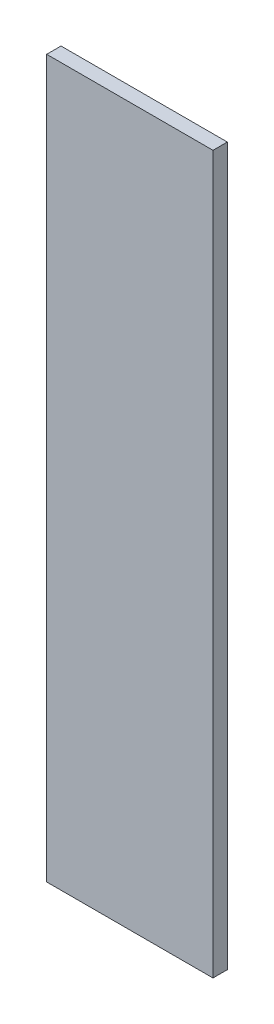
ISO-10303-21;
HEADER;
FILE_DESCRIPTION(('STEP AP214'),'2;1');
FILE_NAME('part.step','',(''),(''),'','','');
FILE_SCHEMA(('AUTOMOTIVE_DESIGN { 1 0 10303 214 1 1 1 1 }'));
ENDSEC;
DATA;
#1=APPLICATION_CONTEXT('core data for automotive mechanical design processes');
#2=APPLICATION_PROTOCOL_DEFINITION('international standard','automotive_design',2000,#1);
#3=PRODUCT_CONTEXT('',#1,'mechanical');
#4=PRODUCT('Part','Part','',(#3));
#5=PRODUCT_RELATED_PRODUCT_CATEGORY('part','',(#4));
#6=PRODUCT_DEFINITION_FORMATION('','',#4);
#7=PRODUCT_DEFINITION_CONTEXT('part definition',#1,'design');
#8=PRODUCT_DEFINITION('design','',#6,#7);
#9=PRODUCT_DEFINITION_SHAPE('','',#8);
#10=(LENGTH_UNIT() NAMED_UNIT(*) SI_UNIT(.MILLI.,.METRE.));
#11=(NAMED_UNIT(*) PLANE_ANGLE_UNIT() SI_UNIT($,.RADIAN.));
#12=(NAMED_UNIT(*) SI_UNIT($,.STERADIAN.) SOLID_ANGLE_UNIT());
#13=UNCERTAINTY_MEASURE_WITH_UNIT(LENGTH_MEASURE(1.E-05),#10,'distance_accuracy_value','');
#14=(GEOMETRIC_REPRESENTATION_CONTEXT(3) GLOBAL_UNCERTAINTY_ASSIGNED_CONTEXT((#13)) GLOBAL_UNIT_ASSIGNED_CONTEXT((#10,
#11,#12)) REPRESENTATION_CONTEXT('',''));
#15=CARTESIAN_POINT('',(0.,0.,0.));
#16=DIRECTION('',(0.,0.,1.));
#17=DIRECTION('',(1.,0.,0.));
#18=AXIS2_PLACEMENT_3D('',#15,#16,#17);
#19=CARTESIAN_POINT('',(0.,250.,5.));
#20=DIRECTION('',(1.,0.,0.));
#21=DIRECTION('',(0.,0.,-1.));
#22=AXIS2_PLACEMENT_3D('',#19,#20,#21);
#23=PLANE('',#22);
#24=DIRECTION('',(0.,-1.,0.));
#25=VECTOR('',#24,1.);
#26=CARTESIAN_POINT('',(0.,250.,0.));
#27=LINE('',#26,#25);
#28=CARTESIAN_POINT('',(0.,250.,0.));
#29=VERTEX_POINT('',#28);
#30=CARTESIAN_POINT('',(0.,0.,0.));
#31=VERTEX_POINT('',#30);
#32=EDGE_CURVE('E96',#29,#31,#27,.T.);
#33=ORIENTED_EDGE('',*,*,#32,.T.);
#34=DIRECTION('',(0.,0.,-1.));
#35=VECTOR('',#34,1.);
#36=CARTESIAN_POINT('',(0.,0.,5.));
#37=LINE('',#36,#35);
#38=CARTESIAN_POINT('',(0.,0.,5.));
#39=VERTEX_POINT('',#38);
#40=EDGE_CURVE('E11',#39,#31,#37,.T.);
#41=ORIENTED_EDGE('',*,*,#40,.F.);
#42=DIRECTION('',(0.,-1.,0.));
#43=VECTOR('',#42,1.);
#44=CARTESIAN_POINT('',(0.,250.,5.));
#45=LINE('',#44,#43);
#46=CARTESIAN_POINT('',(0.,250.,5.));
#47=VERTEX_POINT('',#46);
#48=EDGE_CURVE('E84',#47,#39,#45,.T.);
#49=ORIENTED_EDGE('',*,*,#48,.F.);
#50=DIRECTION('',(0.,0.,-1.));
#51=VECTOR('',#50,1.);
#52=CARTESIAN_POINT('',(0.,250.,5.));
#53=LINE('',#52,#51);
#54=EDGE_CURVE('E92',#47,#29,#53,.T.);
#55=ORIENTED_EDGE('',*,*,#54,.T.);
#56=EDGE_LOOP('',(#33,#41,#49,#55));
#57=FACE_BOUND('',#56,.T.);
#58=ADVANCED_FACE('F33',(#57),#23,.F.);
#59=CARTESIAN_POINT('',(0.,0.,5.));
#60=DIRECTION('',(0.,1.,0.));
#61=DIRECTION('',(0.,0.,1.));
#62=AXIS2_PLACEMENT_3D('',#59,#60,#61);
#63=PLANE('',#62);
#64=DIRECTION('',(1.,0.,0.));
#65=VECTOR('',#64,1.);
#66=CARTESIAN_POINT('',(0.,0.,0.));
#67=LINE('',#66,#65);
#68=CARTESIAN_POINT('',(58.,0.,0.));
#69=VERTEX_POINT('',#68);
#70=EDGE_CURVE('E88',#31,#69,#67,.T.);
#71=ORIENTED_EDGE('',*,*,#70,.T.);
#72=DIRECTION('',(0.,0.,-1.));
#73=VECTOR('',#72,1.);
#74=CARTESIAN_POINT('',(58.,0.,5.));
#75=LINE('',#74,#73);
#76=CARTESIAN_POINT('',(58.,0.,5.));
#77=VERTEX_POINT('',#76);
#78=EDGE_CURVE('E41',#77,#69,#75,.T.);
#79=ORIENTED_EDGE('',*,*,#78,.F.);
#80=DIRECTION('',(1.,0.,0.));
#81=VECTOR('',#80,1.);
#82=CARTESIAN_POINT('',(0.,0.,5.));
#83=LINE('',#82,#81);
#84=EDGE_CURVE('E79',#39,#77,#83,.T.);
#85=ORIENTED_EDGE('',*,*,#84,.F.);
#86=ORIENTED_EDGE('',*,*,#40,.T.);
#87=EDGE_LOOP('',(#71,#79,#85,#86));
#88=FACE_BOUND('',#87,.T.);
#89=ADVANCED_FACE('F87',(#88),#63,.F.);
#90=CARTESIAN_POINT('',(58.,0.,5.));
#91=DIRECTION('',(-1.,0.,0.));
#92=DIRECTION('',(0.,0.,1.));
#93=AXIS2_PLACEMENT_3D('',#90,#91,#92);
#94=PLANE('',#93);
#95=DIRECTION('',(0.,1.,0.));
#96=VECTOR('',#95,1.);
#97=CARTESIAN_POINT('',(58.,0.,0.));
#98=LINE('',#97,#96);
#99=CARTESIAN_POINT('',(58.,250.,0.));
#100=VERTEX_POINT('',#99);
#101=EDGE_CURVE('E66',#69,#100,#98,.T.);
#102=ORIENTED_EDGE('',*,*,#101,.T.);
#103=DIRECTION('',(0.,0.,-1.));
#104=VECTOR('',#103,1.);
#105=CARTESIAN_POINT('',(58.,250.,5.));
#106=LINE('',#105,#104);
#107=CARTESIAN_POINT('',(58.,250.,5.));
#108=VERTEX_POINT('',#107);
#109=EDGE_CURVE('E89',#108,#100,#106,.T.);
#110=ORIENTED_EDGE('',*,*,#109,.F.);
#111=DIRECTION('',(0.,1.,0.));
#112=VECTOR('',#111,1.);
#113=CARTESIAN_POINT('',(58.,0.,5.));
#114=LINE('',#113,#112);
#115=EDGE_CURVE('E82',#77,#108,#114,.T.);
#116=ORIENTED_EDGE('',*,*,#115,.F.);
#117=ORIENTED_EDGE('',*,*,#78,.T.);
#118=EDGE_LOOP('',(#102,#110,#116,#117));
#119=FACE_BOUND('',#118,.T.);
#120=ADVANCED_FACE('F90',(#119),#94,.F.);
#121=CARTESIAN_POINT('',(58.,250.,5.));
#122=DIRECTION('',(0.,-1.,0.));
#123=DIRECTION('',(0.,0.,-1.));
#124=AXIS2_PLACEMENT_3D('',#121,#122,#123);
#125=PLANE('',#124);
#126=DIRECTION('',(-1.,0.,0.));
#127=VECTOR('',#126,1.);
#128=CARTESIAN_POINT('',(58.,250.,0.));
#129=LINE('',#128,#127);
#130=EDGE_CURVE('E72',#100,#29,#129,.T.);
#131=ORIENTED_EDGE('',*,*,#130,.T.);
#132=ORIENTED_EDGE('',*,*,#54,.F.);
#133=DIRECTION('',(-1.,0.,0.));
#134=VECTOR('',#133,1.);
#135=CARTESIAN_POINT('',(58.,250.,5.));
#136=LINE('',#135,#134);
#137=EDGE_CURVE('E49',#108,#47,#136,.T.);
#138=ORIENTED_EDGE('',*,*,#137,.F.);
#139=ORIENTED_EDGE('',*,*,#109,.T.);
#140=EDGE_LOOP('',(#131,#132,#138,#139));
#141=FACE_BOUND('',#140,.T.);
#142=ADVANCED_FACE('F103',(#141),#125,.F.);
#143=CARTESIAN_POINT('',(0.,0.,5.));
#144=DIRECTION('',(0.,0.,1.));
#145=DIRECTION('',(1.,0.,0.));
#146=AXIS2_PLACEMENT_3D('',#143,#144,#145);
#147=PLANE('',#146);
#148=ORIENTED_EDGE('',*,*,#48,.T.);
#149=ORIENTED_EDGE('',*,*,#84,.T.);
#150=ORIENTED_EDGE('',*,*,#115,.T.);
#151=ORIENTED_EDGE('',*,*,#137,.T.);
#152=EDGE_LOOP('',(#148,#149,#150,#151));
#153=FACE_BOUND('',#152,.T.);
#154=ADVANCED_FACE('F80',(#153),#147,.T.);
#155=CARTESIAN_POINT('',(0.,0.,0.));
#156=DIRECTION('',(0.,0.,1.));
#157=DIRECTION('',(1.,0.,0.));
#158=AXIS2_PLACEMENT_3D('',#155,#156,#157);
#159=PLANE('',#158);
#160=ORIENTED_EDGE('',*,*,#32,.F.);
#161=ORIENTED_EDGE('',*,*,#130,.F.);
#162=ORIENTED_EDGE('',*,*,#101,.F.);
#163=ORIENTED_EDGE('',*,*,#70,.F.);
#164=EDGE_LOOP('',(#160,#161,#162,#163));
#165=FACE_BOUND('',#164,.T.);
#166=ADVANCED_FACE('F106',(#165),#159,.F.);
#167=CLOSED_SHELL('',(#58,#89,#120,#142,#154,#166));
#168=MANIFOLD_SOLID_BREP('B2',#167);
#169=ADVANCED_BREP_SHAPE_REPRESENTATION('',(#18,#168),#14);
#170=SHAPE_DEFINITION_REPRESENTATION(#9,#169);
ENDSEC;
END-ISO-10303-21;
